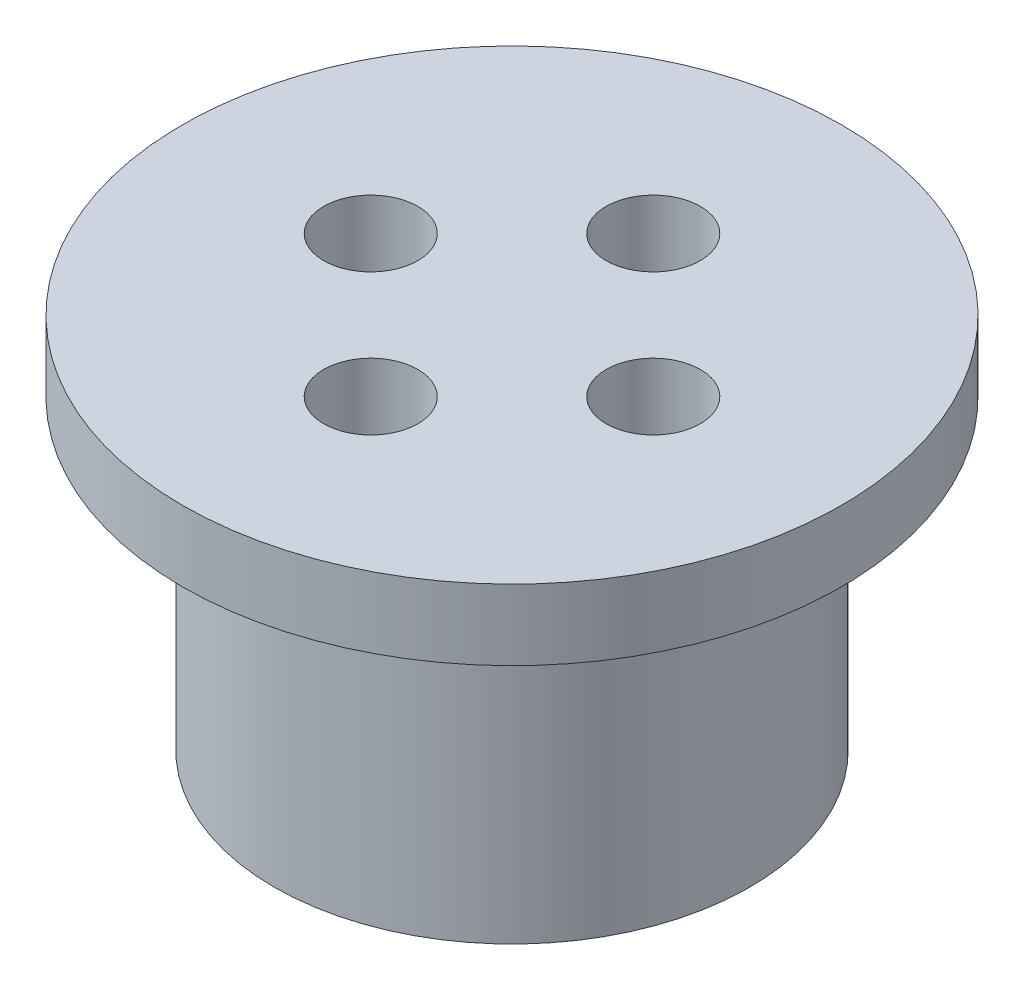
ISO-10303-21;
HEADER;
FILE_DESCRIPTION(('STEP AP214'),'2;1');
FILE_NAME('part.step','',(''),(''),'','','');
FILE_SCHEMA(('AUTOMOTIVE_DESIGN { 1 0 10303 214 1 1 1 1 }'));
ENDSEC;
DATA;
#1=APPLICATION_CONTEXT('core data for automotive mechanical design processes');
#2=APPLICATION_PROTOCOL_DEFINITION('international standard','automotive_design',2000,#1);
#3=PRODUCT_CONTEXT('',#1,'mechanical');
#4=PRODUCT('Part','Part','',(#3));
#5=PRODUCT_RELATED_PRODUCT_CATEGORY('part','',(#4));
#6=PRODUCT_DEFINITION_FORMATION('','',#4);
#7=PRODUCT_DEFINITION_CONTEXT('part definition',#1,'design');
#8=PRODUCT_DEFINITION('design','',#6,#7);
#9=PRODUCT_DEFINITION_SHAPE('','',#8);
#10=(LENGTH_UNIT() NAMED_UNIT(*) SI_UNIT(.MILLI.,.METRE.));
#11=(NAMED_UNIT(*) PLANE_ANGLE_UNIT() SI_UNIT($,.RADIAN.));
#12=(NAMED_UNIT(*) SI_UNIT($,.STERADIAN.) SOLID_ANGLE_UNIT());
#13=UNCERTAINTY_MEASURE_WITH_UNIT(LENGTH_MEASURE(1.E-05),#10,'distance_accuracy_value','');
#14=(GEOMETRIC_REPRESENTATION_CONTEXT(3) GLOBAL_UNCERTAINTY_ASSIGNED_CONTEXT((#13)) GLOBAL_UNIT_ASSIGNED_CONTEXT((#10,
#11,#12)) REPRESENTATION_CONTEXT('',''));
#15=CARTESIAN_POINT('',(0.,0.,0.));
#16=DIRECTION('',(0.,0.,1.));
#17=DIRECTION('',(1.,0.,0.));
#18=AXIS2_PLACEMENT_3D('',#15,#16,#17);
#19=CARTESIAN_POINT('',(0.,13.,0.));
#20=DIRECTION('',(0.,-1.,0.));
#21=DIRECTION('',(0.,0.,-1.));
#22=AXIS2_PLACEMENT_3D('',#19,#20,#21);
#23=CYLINDRICAL_SURFACE('',#22,10.1);
#24=CARTESIAN_POINT('',(0.,13.,0.));
#25=DIRECTION('',(0.,1.,0.));
#26=DIRECTION('',(0.,0.,1.));
#27=AXIS2_PLACEMENT_3D('',#24,#25,#26);
#28=CIRCLE('',#27,10.1);
#29=CARTESIAN_POINT('',(0.,13.,10.1));
#30=VERTEX_POINT('',#29);
#31=EDGE_CURVE('E10',#30,#30,#28,.T.);
#32=ORIENTED_EDGE('',*,*,#31,.F.);
#33=EDGE_LOOP('',(#32));
#34=FACE_BOUND('',#33,.T.);
#35=CARTESIAN_POINT('',(0.,0.,0.));
#36=DIRECTION('',(0.,1.,0.));
#37=DIRECTION('',(0.,0.,1.));
#38=AXIS2_PLACEMENT_3D('',#35,#36,#37);
#39=CIRCLE('',#38,10.1);
#40=CARTESIAN_POINT('',(0.,0.,10.1));
#41=VERTEX_POINT('',#40);
#42=EDGE_CURVE('E46',#41,#41,#39,.T.);
#43=ORIENTED_EDGE('',*,*,#42,.T.);
#44=EDGE_LOOP('',(#43));
#45=FACE_BOUND('',#44,.T.);
#46=ADVANCED_FACE('F43',(#34,#45),#23,.T.);
#47=CARTESIAN_POINT('',(0.,0.,0.));
#48=DIRECTION('',(0.,1.,0.));
#49=DIRECTION('',(0.,0.,1.));
#50=AXIS2_PLACEMENT_3D('',#47,#48,#49);
#51=PLANE('',#50);
#52=CARTESIAN_POINT('',(6.,0.,0.));
#53=DIRECTION('',(0.,-1.,0.));
#54=DIRECTION('',(-1.,0.,0.));
#55=AXIS2_PLACEMENT_3D('',#52,#53,#54);
#56=CIRCLE('',#55,2.);
#57=CARTESIAN_POINT('',(4.,0.,0.));
#58=VERTEX_POINT('',#57);
#59=EDGE_CURVE('E89',#58,#58,#56,.T.);
#60=ORIENTED_EDGE('',*,*,#59,.F.);
#61=EDGE_LOOP('',(#60));
#62=FACE_BOUND('',#61,.T.);
#63=CARTESIAN_POINT('',(0.,0.,-6.));
#64=DIRECTION('',(0.,-1.,0.));
#65=DIRECTION('',(0.,0.,1.));
#66=AXIS2_PLACEMENT_3D('',#63,#64,#65);
#67=CIRCLE('',#66,2.);
#68=CARTESIAN_POINT('',(0.,0.,-4.));
#69=VERTEX_POINT('',#68);
#70=EDGE_CURVE('E81',#69,#69,#67,.T.);
#71=ORIENTED_EDGE('',*,*,#70,.F.);
#72=EDGE_LOOP('',(#71));
#73=FACE_BOUND('',#72,.T.);
#74=CARTESIAN_POINT('',(-6.,0.,0.));
#75=DIRECTION('',(0.,-1.,0.));
#76=DIRECTION('',(1.,0.,0.));
#77=AXIS2_PLACEMENT_3D('',#74,#75,#76);
#78=CIRCLE('',#77,2.);
#79=CARTESIAN_POINT('',(-4.,0.,0.));
#80=VERTEX_POINT('',#79);
#81=EDGE_CURVE('E73',#80,#80,#78,.T.);
#82=ORIENTED_EDGE('',*,*,#81,.F.);
#83=EDGE_LOOP('',(#82));
#84=FACE_BOUND('',#83,.T.);
#85=CARTESIAN_POINT('',(0.,0.,6.));
#86=DIRECTION('',(0.,-1.,0.));
#87=DIRECTION('',(0.,0.,-1.));
#88=AXIS2_PLACEMENT_3D('',#85,#86,#87);
#89=CIRCLE('',#88,2.);
#90=CARTESIAN_POINT('',(0.,0.,4.));
#91=VERTEX_POINT('',#90);
#92=EDGE_CURVE('E65',#91,#91,#89,.T.);
#93=ORIENTED_EDGE('',*,*,#92,.F.);
#94=EDGE_LOOP('',(#93));
#95=FACE_BOUND('',#94,.T.);
#96=ORIENTED_EDGE('',*,*,#42,.F.);
#97=EDGE_LOOP('',(#96));
#98=FACE_BOUND('',#97,.T.);
#99=ADVANCED_FACE('F107',(#62,#73,#84,#95,#98),#51,.F.);
#100=CARTESIAN_POINT('',(0.,16.,0.));
#101=DIRECTION('',(0.,-1.,0.));
#102=DIRECTION('',(0.,0.,-1.));
#103=AXIS2_PLACEMENT_3D('',#100,#101,#102);
#104=CYLINDRICAL_SURFACE('',#103,14.);
#105=CARTESIAN_POINT('',(0.,16.,0.));
#106=DIRECTION('',(0.,1.,0.));
#107=DIRECTION('',(0.,0.,1.));
#108=AXIS2_PLACEMENT_3D('',#105,#106,#107);
#109=CIRCLE('',#108,14.);
#110=CARTESIAN_POINT('',(0.,16.,14.));
#111=VERTEX_POINT('',#110);
#112=EDGE_CURVE('E55',#111,#111,#109,.T.);
#113=ORIENTED_EDGE('',*,*,#112,.F.);
#114=EDGE_LOOP('',(#113));
#115=FACE_BOUND('',#114,.T.);
#116=CARTESIAN_POINT('',(0.,13.,0.));
#117=DIRECTION('',(0.,1.,0.));
#118=DIRECTION('',(0.,0.,1.));
#119=AXIS2_PLACEMENT_3D('',#116,#117,#118);
#120=CIRCLE('',#119,14.);
#121=CARTESIAN_POINT('',(0.,13.,14.));
#122=VERTEX_POINT('',#121);
#123=EDGE_CURVE('E57',#122,#122,#120,.T.);
#124=ORIENTED_EDGE('',*,*,#123,.T.);
#125=EDGE_LOOP('',(#124));
#126=FACE_BOUND('',#125,.T.);
#127=ADVANCED_FACE('F110',(#115,#126),#104,.T.);
#128=CARTESIAN_POINT('',(0.,16.,0.));
#129=DIRECTION('',(0.,1.,0.));
#130=DIRECTION('',(0.,0.,1.));
#131=AXIS2_PLACEMENT_3D('',#128,#129,#130);
#132=PLANE('',#131);
#133=CARTESIAN_POINT('',(6.,16.,0.));
#134=DIRECTION('',(0.,-1.,0.));
#135=DIRECTION('',(-1.,0.,0.));
#136=AXIS2_PLACEMENT_3D('',#133,#134,#135);
#137=CIRCLE('',#136,2.);
#138=CARTESIAN_POINT('',(4.,16.,0.));
#139=VERTEX_POINT('',#138);
#140=EDGE_CURVE('E69',#139,#139,#137,.T.);
#141=ORIENTED_EDGE('',*,*,#140,.T.);
#142=EDGE_LOOP('',(#141));
#143=FACE_BOUND('',#142,.T.);
#144=CARTESIAN_POINT('',(0.,16.,-6.));
#145=DIRECTION('',(0.,-1.,0.));
#146=DIRECTION('',(0.,0.,1.));
#147=AXIS2_PLACEMENT_3D('',#144,#145,#146);
#148=CIRCLE('',#147,2.);
#149=CARTESIAN_POINT('',(0.,16.,-4.));
#150=VERTEX_POINT('',#149);
#151=EDGE_CURVE('E85',#150,#150,#148,.T.);
#152=ORIENTED_EDGE('',*,*,#151,.T.);
#153=EDGE_LOOP('',(#152));
#154=FACE_BOUND('',#153,.T.);
#155=CARTESIAN_POINT('',(-6.,16.,0.));
#156=DIRECTION('',(0.,-1.,0.));
#157=DIRECTION('',(1.,0.,0.));
#158=AXIS2_PLACEMENT_3D('',#155,#156,#157);
#159=CIRCLE('',#158,2.);
#160=CARTESIAN_POINT('',(-4.,16.,0.));
#161=VERTEX_POINT('',#160);
#162=EDGE_CURVE('E77',#161,#161,#159,.T.);
#163=ORIENTED_EDGE('',*,*,#162,.T.);
#164=EDGE_LOOP('',(#163));
#165=FACE_BOUND('',#164,.T.);
#166=CARTESIAN_POINT('',(0.,16.,6.));
#167=DIRECTION('',(0.,-1.,0.));
#168=DIRECTION('',(0.,0.,-1.));
#169=AXIS2_PLACEMENT_3D('',#166,#167,#168);
#170=CIRCLE('',#169,2.);
#171=CARTESIAN_POINT('',(0.,16.,4.));
#172=VERTEX_POINT('',#171);
#173=EDGE_CURVE('E61',#172,#172,#170,.T.);
#174=ORIENTED_EDGE('',*,*,#173,.T.);
#175=EDGE_LOOP('',(#174));
#176=FACE_BOUND('',#175,.T.);
#177=ORIENTED_EDGE('',*,*,#112,.T.);
#178=EDGE_LOOP('',(#177));
#179=FACE_BOUND('',#178,.T.);
#180=ADVANCED_FACE('F97',(#143,#154,#165,#176,#179),#132,.T.);
#181=CARTESIAN_POINT('',(0.,13.,0.));
#182=DIRECTION('',(0.,1.,0.));
#183=DIRECTION('',(0.,0.,1.));
#184=AXIS2_PLACEMENT_3D('',#181,#182,#183);
#185=PLANE('',#184);
#186=ORIENTED_EDGE('',*,*,#31,.T.);
#187=EDGE_LOOP('',(#186));
#188=FACE_BOUND('',#187,.T.);
#189=ORIENTED_EDGE('',*,*,#123,.F.);
#190=EDGE_LOOP('',(#189));
#191=FACE_BOUND('',#190,.T.);
#192=ADVANCED_FACE('F142',(#188,#191),#185,.F.);
#193=CARTESIAN_POINT('',(0.,16.,6.));
#194=DIRECTION('',(0.,-1.,0.));
#195=DIRECTION('',(0.,0.,-1.));
#196=AXIS2_PLACEMENT_3D('',#193,#194,#195);
#197=CYLINDRICAL_SURFACE('',#196,2.);
#198=ORIENTED_EDGE('',*,*,#173,.F.);
#199=EDGE_LOOP('',(#198));
#200=FACE_BOUND('',#199,.T.);
#201=ORIENTED_EDGE('',*,*,#92,.T.);
#202=EDGE_LOOP('',(#201));
#203=FACE_BOUND('',#202,.T.);
#204=ADVANCED_FACE('F149',(#200,#203),#197,.F.);
#205=CARTESIAN_POINT('',(-6.,16.,0.));
#206=DIRECTION('',(0.,-1.,0.));
#207=DIRECTION('',(0.,0.,-1.));
#208=AXIS2_PLACEMENT_3D('',#205,#206,#207);
#209=CYLINDRICAL_SURFACE('',#208,2.);
#210=ORIENTED_EDGE('',*,*,#162,.F.);
#211=EDGE_LOOP('',(#210));
#212=FACE_BOUND('',#211,.T.);
#213=ORIENTED_EDGE('',*,*,#81,.T.);
#214=EDGE_LOOP('',(#213));
#215=FACE_BOUND('',#214,.T.);
#216=ADVANCED_FACE('F155',(#212,#215),#209,.F.);
#217=CARTESIAN_POINT('',(0.,16.,-6.));
#218=DIRECTION('',(0.,-1.,0.));
#219=DIRECTION('',(0.,0.,-1.));
#220=AXIS2_PLACEMENT_3D('',#217,#218,#219);
#221=CYLINDRICAL_SURFACE('',#220,2.);
#222=ORIENTED_EDGE('',*,*,#151,.F.);
#223=EDGE_LOOP('',(#222));
#224=FACE_BOUND('',#223,.T.);
#225=ORIENTED_EDGE('',*,*,#70,.T.);
#226=EDGE_LOOP('',(#225));
#227=FACE_BOUND('',#226,.T.);
#228=ADVANCED_FACE('F103',(#224,#227),#221,.F.);
#229=CARTESIAN_POINT('',(6.,16.,0.));
#230=DIRECTION('',(0.,-1.,0.));
#231=DIRECTION('',(0.,0.,-1.));
#232=AXIS2_PLACEMENT_3D('',#229,#230,#231);
#233=CYLINDRICAL_SURFACE('',#232,2.);
#234=ORIENTED_EDGE('',*,*,#140,.F.);
#235=EDGE_LOOP('',(#234));
#236=FACE_BOUND('',#235,.T.);
#237=ORIENTED_EDGE('',*,*,#59,.T.);
#238=EDGE_LOOP('',(#237));
#239=FACE_BOUND('',#238,.T.);
#240=ADVANCED_FACE('F100',(#236,#239),#233,.F.);
#241=CLOSED_SHELL('',(#46,#99,#127,#180,#192,#204,#216,#228,#240));
#242=MANIFOLD_SOLID_BREP('B2',#241);
#243=ADVANCED_BREP_SHAPE_REPRESENTATION('',(#18,#242),#14);
#244=SHAPE_DEFINITION_REPRESENTATION(#9,#243);
ENDSEC;
END-ISO-10303-21;
